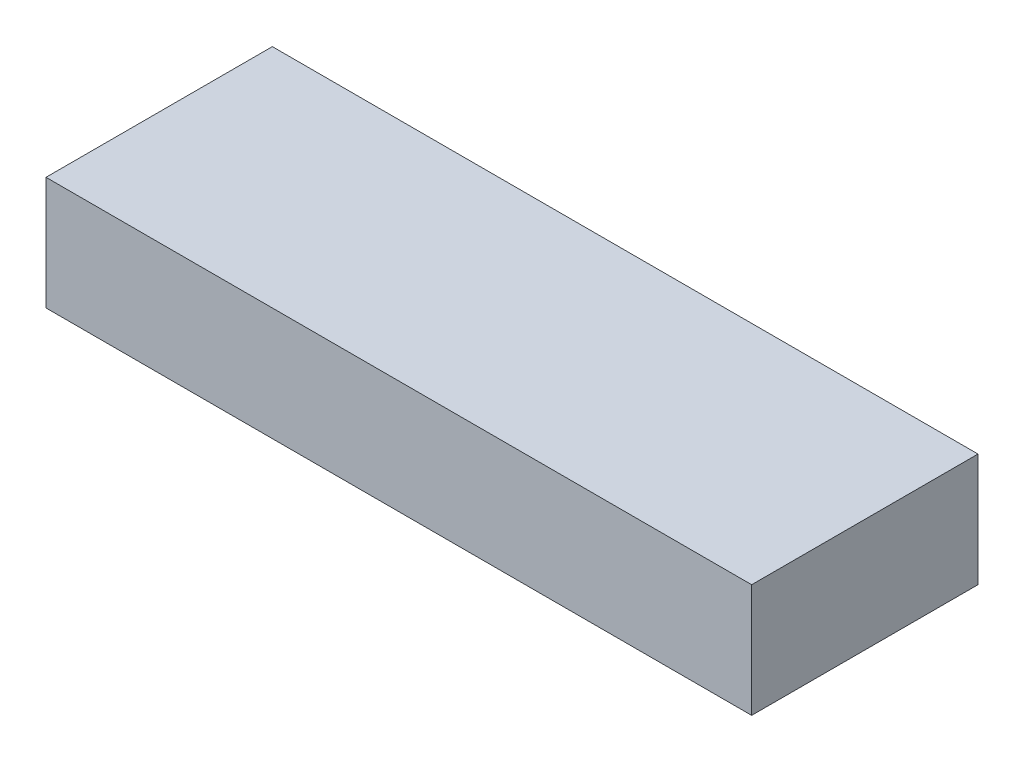
ISO-10303-21;
HEADER;
FILE_DESCRIPTION(('STEP AP214'),'2;1');
FILE_NAME('part.step','',(''),(''),'','','');
FILE_SCHEMA(('AUTOMOTIVE_DESIGN { 1 0 10303 214 1 1 1 1 }'));
ENDSEC;
DATA;
#1=APPLICATION_CONTEXT('core data for automotive mechanical design processes');
#2=APPLICATION_PROTOCOL_DEFINITION('international standard','automotive_design',2000,#1);
#3=PRODUCT_CONTEXT('',#1,'mechanical');
#4=PRODUCT('Part','Part','',(#3));
#5=PRODUCT_RELATED_PRODUCT_CATEGORY('part','',(#4));
#6=PRODUCT_DEFINITION_FORMATION('','',#4);
#7=PRODUCT_DEFINITION_CONTEXT('part definition',#1,'design');
#8=PRODUCT_DEFINITION('design','',#6,#7);
#9=PRODUCT_DEFINITION_SHAPE('','',#8);
#10=(LENGTH_UNIT() NAMED_UNIT(*) SI_UNIT(.MILLI.,.METRE.));
#11=(NAMED_UNIT(*) PLANE_ANGLE_UNIT() SI_UNIT($,.RADIAN.));
#12=(NAMED_UNIT(*) SI_UNIT($,.STERADIAN.) SOLID_ANGLE_UNIT());
#13=UNCERTAINTY_MEASURE_WITH_UNIT(LENGTH_MEASURE(1.E-05),#10,'distance_accuracy_value','');
#14=(GEOMETRIC_REPRESENTATION_CONTEXT(3) GLOBAL_UNCERTAINTY_ASSIGNED_CONTEXT((#13)) GLOBAL_UNIT_ASSIGNED_CONTEXT((#10,
#11,#12)) REPRESENTATION_CONTEXT('',''));
#15=CARTESIAN_POINT('',(0.,0.,0.));
#16=DIRECTION('',(0.,0.,1.));
#17=DIRECTION('',(1.,0.,0.));
#18=AXIS2_PLACEMENT_3D('',#15,#16,#17);
#19=CARTESIAN_POINT('',(-53.,17.,-17.000000036));
#20=DIRECTION('',(1.,0.,0.));
#21=DIRECTION('',(0.,0.,-1.));
#22=AXIS2_PLACEMENT_3D('',#19,#20,#21);
#23=PLANE('',#22);
#24=DIRECTION('',(0.,0.,1.));
#25=VECTOR('',#24,1.);
#26=CARTESIAN_POINT('',(-53.,0.,-17.000000036));
#27=LINE('',#26,#25);
#28=CARTESIAN_POINT('',(-53.,0.,-17.000000036));
#29=VERTEX_POINT('',#28);
#30=CARTESIAN_POINT('',(-53.,0.,17.000000036));
#31=VERTEX_POINT('',#30);
#32=EDGE_CURVE('E99',#29,#31,#27,.T.);
#33=ORIENTED_EDGE('',*,*,#32,.T.);
#34=DIRECTION('',(0.,-1.,0.));
#35=VECTOR('',#34,1.);
#36=CARTESIAN_POINT('',(-53.,17.,17.000000036));
#37=LINE('',#36,#35);
#38=CARTESIAN_POINT('',(-53.,17.,17.000000036));
#39=VERTEX_POINT('',#38);
#40=EDGE_CURVE('E11',#39,#31,#37,.T.);
#41=ORIENTED_EDGE('',*,*,#40,.F.);
#42=DIRECTION('',(0.,0.,1.));
#43=VECTOR('',#42,1.);
#44=CARTESIAN_POINT('',(-53.,17.,-17.000000036));
#45=LINE('',#44,#43);
#46=CARTESIAN_POINT('',(-53.,17.,-17.000000036));
#47=VERTEX_POINT('',#46);
#48=EDGE_CURVE('E87',#47,#39,#45,.T.);
#49=ORIENTED_EDGE('',*,*,#48,.F.);
#50=DIRECTION('',(0.,-1.,0.));
#51=VECTOR('',#50,1.);
#52=CARTESIAN_POINT('',(-53.,17.,-17.000000036));
#53=LINE('',#52,#51);
#54=EDGE_CURVE('E95',#47,#29,#53,.T.);
#55=ORIENTED_EDGE('',*,*,#54,.T.);
#56=EDGE_LOOP('',(#33,#41,#49,#55));
#57=FACE_BOUND('',#56,.T.);
#58=ADVANCED_FACE('F36',(#57),#23,.F.);
#59=CARTESIAN_POINT('',(-53.,17.,17.000000036));
#60=DIRECTION('',(0.,0.,-1.));
#61=DIRECTION('',(-1.,0.,0.));
#62=AXIS2_PLACEMENT_3D('',#59,#60,#61);
#63=PLANE('',#62);
#64=DIRECTION('',(1.,0.,0.));
#65=VECTOR('',#64,1.);
#66=CARTESIAN_POINT('',(-53.,0.,17.000000036));
#67=LINE('',#66,#65);
#68=CARTESIAN_POINT('',(53.,0.,17.000000036));
#69=VERTEX_POINT('',#68);
#70=EDGE_CURVE('E91',#31,#69,#67,.T.);
#71=ORIENTED_EDGE('',*,*,#70,.T.);
#72=DIRECTION('',(0.,-1.,0.));
#73=VECTOR('',#72,1.);
#74=CARTESIAN_POINT('',(53.,17.,17.000000036));
#75=LINE('',#74,#73);
#76=CARTESIAN_POINT('',(53.,17.,17.000000036));
#77=VERTEX_POINT('',#76);
#78=EDGE_CURVE('E44',#77,#69,#75,.T.);
#79=ORIENTED_EDGE('',*,*,#78,.F.);
#80=DIRECTION('',(1.,0.,0.));
#81=VECTOR('',#80,1.);
#82=CARTESIAN_POINT('',(-53.,17.,17.000000036));
#83=LINE('',#82,#81);
#84=EDGE_CURVE('E82',#39,#77,#83,.T.);
#85=ORIENTED_EDGE('',*,*,#84,.F.);
#86=ORIENTED_EDGE('',*,*,#40,.T.);
#87=EDGE_LOOP('',(#71,#79,#85,#86));
#88=FACE_BOUND('',#87,.T.);
#89=ADVANCED_FACE('F90',(#88),#63,.F.);
#90=CARTESIAN_POINT('',(53.,17.,-17.000000036));
#91=DIRECTION('',(-1.,0.,0.));
#92=DIRECTION('',(0.,0.,1.));
#93=AXIS2_PLACEMENT_3D('',#90,#91,#92);
#94=PLANE('',#93);
#95=DIRECTION('',(0.,0.,-1.));
#96=VECTOR('',#95,1.);
#97=CARTESIAN_POINT('',(53.,0.,-17.000000036));
#98=LINE('',#97,#96);
#99=CARTESIAN_POINT('',(53.,0.,-17.000000036));
#100=VERTEX_POINT('',#99);
#101=EDGE_CURVE('E69',#69,#100,#98,.T.);
#102=ORIENTED_EDGE('',*,*,#101,.T.);
#103=DIRECTION('',(0.,-1.,0.));
#104=VECTOR('',#103,1.);
#105=CARTESIAN_POINT('',(53.,17.,-17.000000036));
#106=LINE('',#105,#104);
#107=CARTESIAN_POINT('',(53.,17.,-17.000000036));
#108=VERTEX_POINT('',#107);
#109=EDGE_CURVE('E92',#108,#100,#106,.T.);
#110=ORIENTED_EDGE('',*,*,#109,.F.);
#111=DIRECTION('',(0.,0.,-1.));
#112=VECTOR('',#111,1.);
#113=CARTESIAN_POINT('',(53.,17.,-17.000000036));
#114=LINE('',#113,#112);
#115=EDGE_CURVE('E85',#77,#108,#114,.T.);
#116=ORIENTED_EDGE('',*,*,#115,.F.);
#117=ORIENTED_EDGE('',*,*,#78,.T.);
#118=EDGE_LOOP('',(#102,#110,#116,#117));
#119=FACE_BOUND('',#118,.T.);
#120=ADVANCED_FACE('F93',(#119),#94,.F.);
#121=CARTESIAN_POINT('',(-53.,17.,-17.000000036));
#122=DIRECTION('',(0.,0.,1.));
#123=DIRECTION('',(1.,0.,0.));
#124=AXIS2_PLACEMENT_3D('',#121,#122,#123);
#125=PLANE('',#124);
#126=DIRECTION('',(-1.,0.,0.));
#127=VECTOR('',#126,1.);
#128=CARTESIAN_POINT('',(-53.,0.,-17.000000036));
#129=LINE('',#128,#127);
#130=EDGE_CURVE('E75',#100,#29,#129,.T.);
#131=ORIENTED_EDGE('',*,*,#130,.T.);
#132=ORIENTED_EDGE('',*,*,#54,.F.);
#133=DIRECTION('',(-1.,0.,0.));
#134=VECTOR('',#133,1.);
#135=CARTESIAN_POINT('',(-53.,17.,-17.000000036));
#136=LINE('',#135,#134);
#137=EDGE_CURVE('E52',#108,#47,#136,.T.);
#138=ORIENTED_EDGE('',*,*,#137,.F.);
#139=ORIENTED_EDGE('',*,*,#109,.T.);
#140=EDGE_LOOP('',(#131,#132,#138,#139));
#141=FACE_BOUND('',#140,.T.);
#142=ADVANCED_FACE('F106',(#141),#125,.F.);
#143=CARTESIAN_POINT('',(0.,17.,0.));
#144=DIRECTION('',(0.,1.,0.));
#145=DIRECTION('',(0.,0.,1.));
#146=AXIS2_PLACEMENT_3D('',#143,#144,#145);
#147=PLANE('',#146);
#148=ORIENTED_EDGE('',*,*,#48,.T.);
#149=ORIENTED_EDGE('',*,*,#84,.T.);
#150=ORIENTED_EDGE('',*,*,#115,.T.);
#151=ORIENTED_EDGE('',*,*,#137,.T.);
#152=EDGE_LOOP('',(#148,#149,#150,#151));
#153=FACE_BOUND('',#152,.T.);
#154=ADVANCED_FACE('F83',(#153),#147,.T.);
#155=CARTESIAN_POINT('',(0.,0.,0.));
#156=DIRECTION('',(0.,1.,0.));
#157=DIRECTION('',(0.,0.,1.));
#158=AXIS2_PLACEMENT_3D('',#155,#156,#157);
#159=PLANE('',#158);
#160=ORIENTED_EDGE('',*,*,#32,.F.);
#161=ORIENTED_EDGE('',*,*,#130,.F.);
#162=ORIENTED_EDGE('',*,*,#101,.F.);
#163=ORIENTED_EDGE('',*,*,#70,.F.);
#164=EDGE_LOOP('',(#160,#161,#162,#163));
#165=FACE_BOUND('',#164,.T.);
#166=ADVANCED_FACE('F109',(#165),#159,.F.);
#167=CLOSED_SHELL('',(#58,#89,#120,#142,#154,#166));
#168=MANIFOLD_SOLID_BREP('B2',#167);
#169=ADVANCED_BREP_SHAPE_REPRESENTATION('',(#18,#168),#14);
#170=SHAPE_DEFINITION_REPRESENTATION(#9,#169);
ENDSEC;
END-ISO-10303-21;
